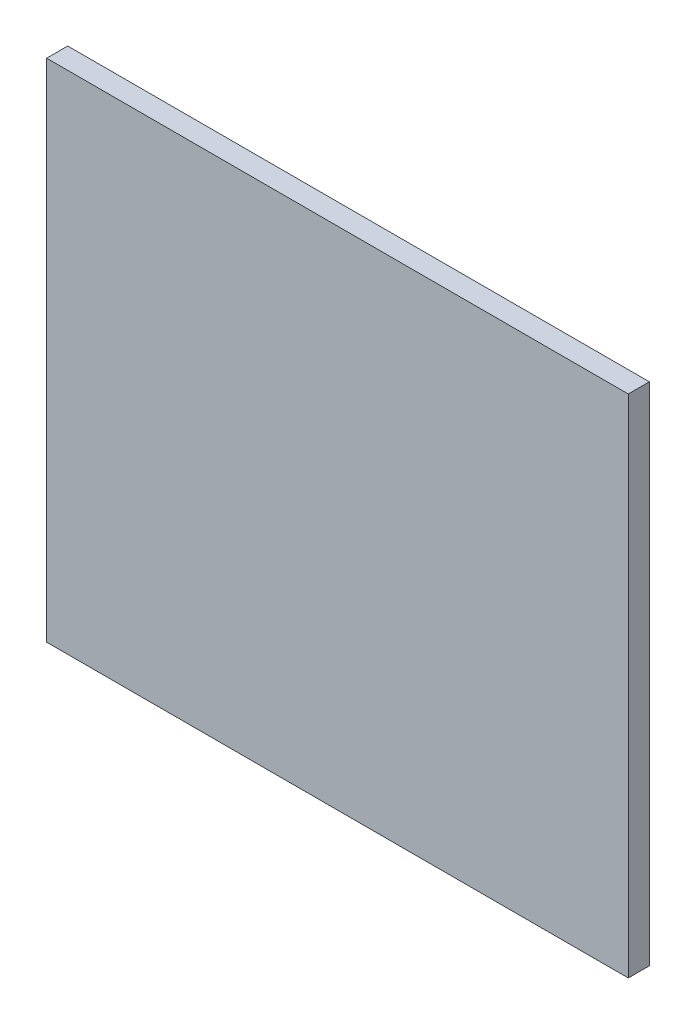
ISO-10303-21;
HEADER;
FILE_DESCRIPTION(('STEP AP214'),'2;1');
FILE_NAME('part.step','',(''),(''),'','','');
FILE_SCHEMA(('AUTOMOTIVE_DESIGN { 1 0 10303 214 1 1 1 1 }'));
ENDSEC;
DATA;
#1=APPLICATION_CONTEXT('core data for automotive mechanical design processes');
#2=APPLICATION_PROTOCOL_DEFINITION('international standard','automotive_design',2000,#1);
#3=PRODUCT_CONTEXT('',#1,'mechanical');
#4=PRODUCT('Part','Part','',(#3));
#5=PRODUCT_RELATED_PRODUCT_CATEGORY('part','',(#4));
#6=PRODUCT_DEFINITION_FORMATION('','',#4);
#7=PRODUCT_DEFINITION_CONTEXT('part definition',#1,'design');
#8=PRODUCT_DEFINITION('design','',#6,#7);
#9=PRODUCT_DEFINITION_SHAPE('','',#8);
#10=(LENGTH_UNIT() NAMED_UNIT(*) SI_UNIT(.MILLI.,.METRE.));
#11=(NAMED_UNIT(*) PLANE_ANGLE_UNIT() SI_UNIT($,.RADIAN.));
#12=(NAMED_UNIT(*) SI_UNIT($,.STERADIAN.) SOLID_ANGLE_UNIT());
#13=UNCERTAINTY_MEASURE_WITH_UNIT(LENGTH_MEASURE(1.E-05),#10,'distance_accuracy_value','');
#14=(GEOMETRIC_REPRESENTATION_CONTEXT(3) GLOBAL_UNCERTAINTY_ASSIGNED_CONTEXT((#13)) GLOBAL_UNIT_ASSIGNED_CONTEXT((#10,
#11,#12)) REPRESENTATION_CONTEXT('',''));
#15=CARTESIAN_POINT('',(0.,0.,0.));
#16=DIRECTION('',(0.,0.,1.));
#17=DIRECTION('',(1.,0.,0.));
#18=AXIS2_PLACEMENT_3D('',#15,#16,#17);
#19=CARTESIAN_POINT('',(-43.815,38.1,3.175));
#20=DIRECTION('',(1.,0.,0.));
#21=DIRECTION('',(0.,0.,-1.));
#22=AXIS2_PLACEMENT_3D('',#19,#20,#21);
#23=PLANE('',#22);
#24=DIRECTION('',(0.,-1.,0.));
#25=VECTOR('',#24,1.);
#26=CARTESIAN_POINT('',(-43.815,38.1,0.));
#27=LINE('',#26,#25);
#28=CARTESIAN_POINT('',(-43.815,38.1,0.));
#29=VERTEX_POINT('',#28);
#30=CARTESIAN_POINT('',(-43.815,-38.1,0.));
#31=VERTEX_POINT('',#30);
#32=EDGE_CURVE('E99',#29,#31,#27,.T.);
#33=ORIENTED_EDGE('',*,*,#32,.T.);
#34=DIRECTION('',(0.,0.,-1.));
#35=VECTOR('',#34,1.);
#36=CARTESIAN_POINT('',(-43.815,-38.1,3.175));
#37=LINE('',#36,#35);
#38=CARTESIAN_POINT('',(-43.815,-38.1,3.175));
#39=VERTEX_POINT('',#38);
#40=EDGE_CURVE('E11',#39,#31,#37,.T.);
#41=ORIENTED_EDGE('',*,*,#40,.F.);
#42=DIRECTION('',(0.,-1.,0.));
#43=VECTOR('',#42,1.);
#44=CARTESIAN_POINT('',(-43.815,38.1,3.175));
#45=LINE('',#44,#43);
#46=CARTESIAN_POINT('',(-43.815,38.1,3.175));
#47=VERTEX_POINT('',#46);
#48=EDGE_CURVE('E87',#47,#39,#45,.T.);
#49=ORIENTED_EDGE('',*,*,#48,.F.);
#50=DIRECTION('',(0.,0.,-1.));
#51=VECTOR('',#50,1.);
#52=CARTESIAN_POINT('',(-43.815,38.1,3.175));
#53=LINE('',#52,#51);
#54=EDGE_CURVE('E95',#47,#29,#53,.T.);
#55=ORIENTED_EDGE('',*,*,#54,.T.);
#56=EDGE_LOOP('',(#33,#41,#49,#55));
#57=FACE_BOUND('',#56,.T.);
#58=ADVANCED_FACE('F36',(#57),#23,.F.);
#59=CARTESIAN_POINT('',(-43.815,-38.1,3.175));
#60=DIRECTION('',(0.,1.,0.));
#61=DIRECTION('',(0.,0.,1.));
#62=AXIS2_PLACEMENT_3D('',#59,#60,#61);
#63=PLANE('',#62);
#64=DIRECTION('',(1.,0.,0.));
#65=VECTOR('',#64,1.);
#66=CARTESIAN_POINT('',(-43.815,-38.1,0.));
#67=LINE('',#66,#65);
#68=CARTESIAN_POINT('',(43.815,-38.1,0.));
#69=VERTEX_POINT('',#68);
#70=EDGE_CURVE('E91',#31,#69,#67,.T.);
#71=ORIENTED_EDGE('',*,*,#70,.T.);
#72=DIRECTION('',(0.,0.,-1.));
#73=VECTOR('',#72,1.);
#74=CARTESIAN_POINT('',(43.815,-38.1,3.175));
#75=LINE('',#74,#73);
#76=CARTESIAN_POINT('',(43.815,-38.1,3.175));
#77=VERTEX_POINT('',#76);
#78=EDGE_CURVE('E44',#77,#69,#75,.T.);
#79=ORIENTED_EDGE('',*,*,#78,.F.);
#80=DIRECTION('',(1.,0.,0.));
#81=VECTOR('',#80,1.);
#82=CARTESIAN_POINT('',(-43.815,-38.1,3.175));
#83=LINE('',#82,#81);
#84=EDGE_CURVE('E82',#39,#77,#83,.T.);
#85=ORIENTED_EDGE('',*,*,#84,.F.);
#86=ORIENTED_EDGE('',*,*,#40,.T.);
#87=EDGE_LOOP('',(#71,#79,#85,#86));
#88=FACE_BOUND('',#87,.T.);
#89=ADVANCED_FACE('F90',(#88),#63,.F.);
#90=CARTESIAN_POINT('',(43.815,38.1,3.175));
#91=DIRECTION('',(-1.,0.,0.));
#92=DIRECTION('',(0.,-1.,0.));
#93=AXIS2_PLACEMENT_3D('',#90,#91,#92);
#94=PLANE('',#93);
#95=DIRECTION('',(0.,1.,0.));
#96=VECTOR('',#95,1.);
#97=CARTESIAN_POINT('',(43.815,38.1,0.));
#98=LINE('',#97,#96);
#99=CARTESIAN_POINT('',(43.815,38.1,0.));
#100=VERTEX_POINT('',#99);
#101=EDGE_CURVE('E69',#69,#100,#98,.T.);
#102=ORIENTED_EDGE('',*,*,#101,.T.);
#103=DIRECTION('',(0.,0.,-1.));
#104=VECTOR('',#103,1.);
#105=CARTESIAN_POINT('',(43.815,38.1,3.175));
#106=LINE('',#105,#104);
#107=CARTESIAN_POINT('',(43.815,38.1,3.175));
#108=VERTEX_POINT('',#107);
#109=EDGE_CURVE('E92',#108,#100,#106,.T.);
#110=ORIENTED_EDGE('',*,*,#109,.F.);
#111=DIRECTION('',(0.,1.,0.));
#112=VECTOR('',#111,1.);
#113=CARTESIAN_POINT('',(43.815,38.1,3.175));
#114=LINE('',#113,#112);
#115=EDGE_CURVE('E85',#77,#108,#114,.T.);
#116=ORIENTED_EDGE('',*,*,#115,.F.);
#117=ORIENTED_EDGE('',*,*,#78,.T.);
#118=EDGE_LOOP('',(#102,#110,#116,#117));
#119=FACE_BOUND('',#118,.T.);
#120=ADVANCED_FACE('F93',(#119),#94,.F.);
#121=CARTESIAN_POINT('',(-43.815,38.1,3.175));
#122=DIRECTION('',(0.,-1.,0.));
#123=DIRECTION('',(0.,0.,-1.));
#124=AXIS2_PLACEMENT_3D('',#121,#122,#123);
#125=PLANE('',#124);
#126=DIRECTION('',(-1.,0.,0.));
#127=VECTOR('',#126,1.);
#128=CARTESIAN_POINT('',(-43.815,38.1,0.));
#129=LINE('',#128,#127);
#130=EDGE_CURVE('E75',#100,#29,#129,.T.);
#131=ORIENTED_EDGE('',*,*,#130,.T.);
#132=ORIENTED_EDGE('',*,*,#54,.F.);
#133=DIRECTION('',(-1.,0.,0.));
#134=VECTOR('',#133,1.);
#135=CARTESIAN_POINT('',(-43.815,38.1,3.175));
#136=LINE('',#135,#134);
#137=EDGE_CURVE('E52',#108,#47,#136,.T.);
#138=ORIENTED_EDGE('',*,*,#137,.F.);
#139=ORIENTED_EDGE('',*,*,#109,.T.);
#140=EDGE_LOOP('',(#131,#132,#138,#139));
#141=FACE_BOUND('',#140,.T.);
#142=ADVANCED_FACE('F106',(#141),#125,.F.);
#143=CARTESIAN_POINT('',(0.,0.,3.175));
#144=DIRECTION('',(0.,0.,1.));
#145=DIRECTION('',(1.,0.,0.));
#146=AXIS2_PLACEMENT_3D('',#143,#144,#145);
#147=PLANE('',#146);
#148=ORIENTED_EDGE('',*,*,#48,.T.);
#149=ORIENTED_EDGE('',*,*,#84,.T.);
#150=ORIENTED_EDGE('',*,*,#115,.T.);
#151=ORIENTED_EDGE('',*,*,#137,.T.);
#152=EDGE_LOOP('',(#148,#149,#150,#151));
#153=FACE_BOUND('',#152,.T.);
#154=ADVANCED_FACE('F83',(#153),#147,.T.);
#155=CARTESIAN_POINT('',(0.,0.,0.));
#156=DIRECTION('',(0.,0.,1.));
#157=DIRECTION('',(1.,0.,0.));
#158=AXIS2_PLACEMENT_3D('',#155,#156,#157);
#159=PLANE('',#158);
#160=ORIENTED_EDGE('',*,*,#32,.F.);
#161=ORIENTED_EDGE('',*,*,#130,.F.);
#162=ORIENTED_EDGE('',*,*,#101,.F.);
#163=ORIENTED_EDGE('',*,*,#70,.F.);
#164=EDGE_LOOP('',(#160,#161,#162,#163));
#165=FACE_BOUND('',#164,.T.);
#166=ADVANCED_FACE('F109',(#165),#159,.F.);
#167=CLOSED_SHELL('',(#58,#89,#120,#142,#154,#166));
#168=MANIFOLD_SOLID_BREP('B2',#167);
#169=ADVANCED_BREP_SHAPE_REPRESENTATION('',(#18,#168),#14);
#170=SHAPE_DEFINITION_REPRESENTATION(#9,#169);
ENDSEC;
END-ISO-10303-21;
